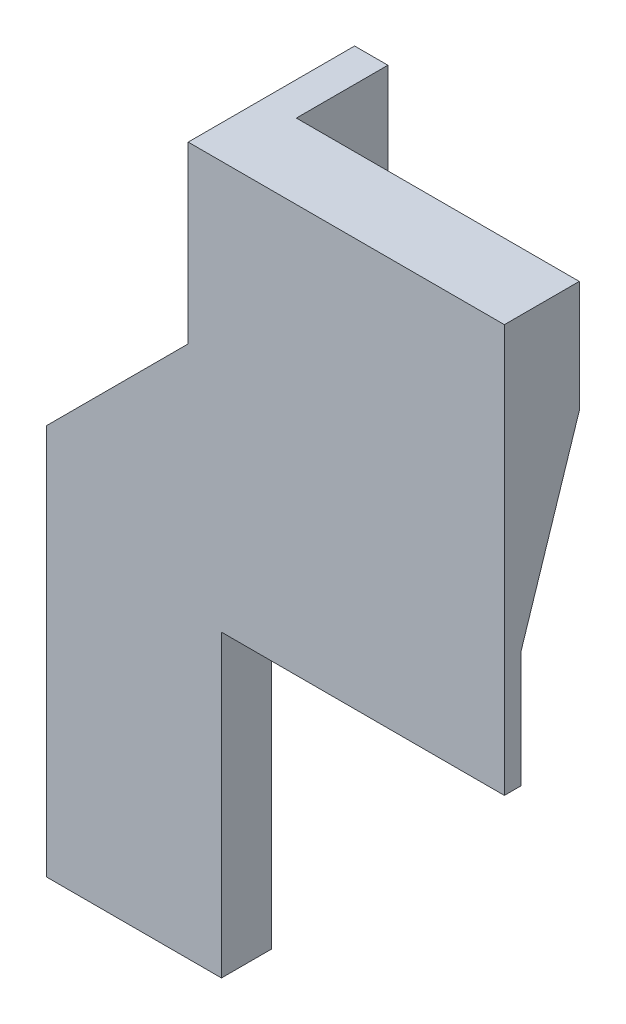
ISO-10303-21;
HEADER;
FILE_DESCRIPTION(('STEP AP214'),'2;1');
FILE_NAME('part.step','',(''),(''),'','','');
FILE_SCHEMA(('AUTOMOTIVE_DESIGN { 1 0 10303 214 1 1 1 1 }'));
ENDSEC;
DATA;
#1=APPLICATION_CONTEXT('core data for automotive mechanical design processes');
#2=APPLICATION_PROTOCOL_DEFINITION('international standard','automotive_design',2000,#1);
#3=PRODUCT_CONTEXT('',#1,'mechanical');
#4=PRODUCT('Part','Part','',(#3));
#5=PRODUCT_RELATED_PRODUCT_CATEGORY('part','',(#4));
#6=PRODUCT_DEFINITION_FORMATION('','',#4);
#7=PRODUCT_DEFINITION_CONTEXT('part definition',#1,'design');
#8=PRODUCT_DEFINITION('design','',#6,#7);
#9=PRODUCT_DEFINITION_SHAPE('','',#8);
#10=(LENGTH_UNIT() NAMED_UNIT(*) SI_UNIT(.MILLI.,.METRE.));
#11=(NAMED_UNIT(*) PLANE_ANGLE_UNIT() SI_UNIT($,.RADIAN.));
#12=(NAMED_UNIT(*) SI_UNIT($,.STERADIAN.) SOLID_ANGLE_UNIT());
#13=UNCERTAINTY_MEASURE_WITH_UNIT(LENGTH_MEASURE(1.E-05),#10,'distance_accuracy_value','');
#14=(GEOMETRIC_REPRESENTATION_CONTEXT(3) GLOBAL_UNCERTAINTY_ASSIGNED_CONTEXT((#13)) GLOBAL_UNIT_ASSIGNED_CONTEXT((#10,
#11,#12)) REPRESENTATION_CONTEXT('',''));
#15=CARTESIAN_POINT('',(0.,0.,0.));
#16=DIRECTION('',(0.,0.,1.));
#17=DIRECTION('',(1.,0.,0.));
#18=AXIS2_PLACEMENT_3D('',#15,#16,#17);
#19=CARTESIAN_POINT('',(0.,0.,2.));
#20=DIRECTION('',(0.,0.,1.));
#21=DIRECTION('',(1.,0.,0.));
#22=AXIS2_PLACEMENT_3D('',#19,#20,#21);
#23=PLANE('',#22);
#24=DIRECTION('',(1.,0.,0.));
#25=VECTOR('',#24,1.);
#26=CARTESIAN_POINT('',(-15.,36.,2.));
#27=LINE('',#26,#25);
#28=CARTESIAN_POINT('',(-15.,36.,2.));
#29=VERTEX_POINT('',#28);
#30=CARTESIAN_POINT('',(19.,36.,2.));
#31=VERTEX_POINT('',#30);
#32=EDGE_CURVE('E252',#29,#31,#27,.T.);
#33=ORIENTED_EDGE('',*,*,#32,.T.);
#34=DIRECTION('',(0.,-1.,0.));
#35=VECTOR('',#34,1.);
#36=CARTESIAN_POINT('',(19.,85.,2.));
#37=LINE('',#36,#35);
#38=CARTESIAN_POINT('',(19.,85.,2.));
#39=VERTEX_POINT('',#38);
#40=EDGE_CURVE('E157',#39,#31,#37,.T.);
#41=ORIENTED_EDGE('',*,*,#40,.F.);
#42=DIRECTION('',(1.,0.,0.));
#43=VECTOR('',#42,1.);
#44=CARTESIAN_POINT('',(-19.,85.,2.));
#45=LINE('',#44,#43);
#46=CARTESIAN_POINT('',(-19.,85.,2.));
#47=VERTEX_POINT('',#46);
#48=EDGE_CURVE('E153',#47,#39,#45,.T.);
#49=ORIENTED_EDGE('',*,*,#48,.F.);
#50=DIRECTION('',(0.,1.,0.));
#51=VECTOR('',#50,1.);
#52=CARTESIAN_POINT('',(-19.,64.,2.));
#53=LINE('',#52,#51);
#54=CARTESIAN_POINT('',(-19.,64.,2.));
#55=VERTEX_POINT('',#54);
#56=EDGE_CURVE('E215',#55,#47,#53,.T.);
#57=ORIENTED_EDGE('',*,*,#56,.F.);
#58=DIRECTION('',(0.707106781186548,0.707106781186547,0.));
#59=VECTOR('',#58,1.);
#60=CARTESIAN_POINT('',(-36.,47.,2.));
#61=LINE('',#60,#59);
#62=CARTESIAN_POINT('',(-36.,47.,2.));
#63=VERTEX_POINT('',#62);
#64=EDGE_CURVE('E220',#63,#55,#61,.T.);
#65=ORIENTED_EDGE('',*,*,#64,.F.);
#66=DIRECTION('',(0.,1.,0.));
#67=VECTOR('',#66,1.);
#68=CARTESIAN_POINT('',(-36.,0.,2.));
#69=LINE('',#68,#67);
#70=CARTESIAN_POINT('',(-36.,0.,2.));
#71=VERTEX_POINT('',#70);
#72=EDGE_CURVE('E224',#71,#63,#69,.T.);
#73=ORIENTED_EDGE('',*,*,#72,.F.);
#74=DIRECTION('',(1.,0.,0.));
#75=VECTOR('',#74,1.);
#76=CARTESIAN_POINT('',(-30.,0.,2.));
#77=LINE('',#76,#75);
#78=CARTESIAN_POINT('',(-15.,0.,2.));
#79=VERTEX_POINT('',#78);
#80=EDGE_CURVE('E247',#71,#79,#77,.T.);
#81=ORIENTED_EDGE('',*,*,#80,.T.);
#82=DIRECTION('',(0.,1.,0.));
#83=VECTOR('',#82,1.);
#84=CARTESIAN_POINT('',(-15.,0.,2.));
#85=LINE('',#84,#83);
#86=EDGE_CURVE('E250',#79,#29,#85,.T.);
#87=ORIENTED_EDGE('',*,*,#86,.T.);
#88=EDGE_LOOP('',(#33,#41,#49,#57,#65,#73,#81,#87));
#89=FACE_BOUND('',#88,.T.);
#90=ADVANCED_FACE('F33',(#89),#23,.T.);
#91=CARTESIAN_POINT('',(-76.400325732035,71.5437847602267,-6.99999999999999));
#92=DIRECTION('',(0.,0.,-1.));
#93=DIRECTION('',(-1.,0.,0.));
#94=AXIS2_PLACEMENT_3D('',#91,#92,#93);
#95=PLANE('',#94);
#96=DIRECTION('',(0.,-1.,0.));
#97=VECTOR('',#96,1.);
#98=CARTESIAN_POINT('',(-15.,71.5437847602267,-6.99999999999999));
#99=LINE('',#98,#97);
#100=CARTESIAN_POINT('',(-15.,85.,-6.99999999999999));
#101=VERTEX_POINT('',#100);
#102=CARTESIAN_POINT('',(-15.,71.5437847602267,-6.99999999999999));
#103=VERTEX_POINT('',#102);
#104=EDGE_CURVE('E146',#101,#103,#99,.T.);
#105=ORIENTED_EDGE('',*,*,#104,.F.);
#106=DIRECTION('',(-1.,0.,0.));
#107=VECTOR('',#106,1.);
#108=CARTESIAN_POINT('',(15.,85.,-6.99999999999999));
#109=LINE('',#108,#107);
#110=CARTESIAN_POINT('',(19.,85.,-6.99999999999999));
#111=VERTEX_POINT('',#110);
#112=EDGE_CURVE('E140',#111,#101,#109,.T.);
#113=ORIENTED_EDGE('',*,*,#112,.F.);
#114=DIRECTION('',(0.,1.,0.));
#115=VECTOR('',#114,1.);
#116=CARTESIAN_POINT('',(19.,71.5437847602267,-6.99999999999999));
#117=LINE('',#116,#115);
#118=CARTESIAN_POINT('',(19.,71.5437847602267,-6.99999999999999));
#119=VERTEX_POINT('',#118);
#120=EDGE_CURVE('E145',#119,#111,#117,.T.);
#121=ORIENTED_EDGE('',*,*,#120,.F.);
#122=DIRECTION('',(1.,0.,0.));
#123=VECTOR('',#122,1.);
#124=CARTESIAN_POINT('',(-76.400325732035,71.5437847602267,-6.99999999999999));
#125=LINE('',#124,#123);
#126=EDGE_CURVE('E239',#103,#119,#125,.T.);
#127=ORIENTED_EDGE('',*,*,#126,.F.);
#128=EDGE_LOOP('',(#105,#113,#121,#127));
#129=FACE_BOUND('',#128,.T.);
#130=ADVANCED_FACE('F142',(#129),#95,.T.);
#131=CARTESIAN_POINT('',(-19.,64.,114.969022302576));
#132=DIRECTION('',(-1.,0.,0.));
#133=DIRECTION('',(0.,0.,1.));
#134=AXIS2_PLACEMENT_3D('',#131,#132,#133);
#135=PLANE('',#134);
#136=ORIENTED_EDGE('',*,*,#56,.T.);
#137=DIRECTION('',(0.,0.,1.));
#138=VECTOR('',#137,1.);
#139=CARTESIAN_POINT('',(-19.,85.,-18.));
#140=LINE('',#139,#138);
#141=CARTESIAN_POINT('',(-19.,85.,-18.));
#142=VERTEX_POINT('',#141);
#143=EDGE_CURVE('E175',#142,#47,#140,.T.);
#144=ORIENTED_EDGE('',*,*,#143,.F.);
#145=DIRECTION('',(0.,1.,0.));
#146=VECTOR('',#145,1.);
#147=CARTESIAN_POINT('',(-19.,64.,-18.));
#148=LINE('',#147,#146);
#149=CARTESIAN_POINT('',(-19.,64.,-18.));
#150=VERTEX_POINT('',#149);
#151=EDGE_CURVE('E195',#150,#142,#148,.T.);
#152=ORIENTED_EDGE('',*,*,#151,.F.);
#153=DIRECTION('',(0.,0.,-1.));
#154=VECTOR('',#153,1.);
#155=CARTESIAN_POINT('',(-19.,64.,114.969022302576));
#156=LINE('',#155,#154);
#157=EDGE_CURVE('E219',#55,#150,#156,.T.);
#158=ORIENTED_EDGE('',*,*,#157,.F.);
#159=EDGE_LOOP('',(#136,#144,#152,#158));
#160=FACE_BOUND('',#159,.T.);
#161=ADVANCED_FACE('F286',(#160),#135,.T.);
#162=CARTESIAN_POINT('',(-15.,111.,-18.));
#163=DIRECTION('',(-1.,0.,0.));
#164=DIRECTION('',(0.,-1.,0.));
#165=AXIS2_PLACEMENT_3D('',#162,#163,#164);
#166=PLANE('',#165);
#167=DIRECTION('',(0.,0.,-1.));
#168=VECTOR('',#167,1.);
#169=CARTESIAN_POINT('',(-15.,85.,-6.99999999999999));
#170=LINE('',#169,#168);
#171=CARTESIAN_POINT('',(-15.,85.,-18.));
#172=VERTEX_POINT('',#171);
#173=EDGE_CURVE('E48',#101,#172,#170,.T.);
#174=ORIENTED_EDGE('',*,*,#173,.F.);
#175=ORIENTED_EDGE('',*,*,#104,.T.);
#176=DIRECTION('',(0.,-0.951056516295153,0.309016994374948));
#177=VECTOR('',#176,1.);
#178=CARTESIAN_POINT('',(-15.,50.,0.));
#179=LINE('',#178,#177);
#180=CARTESIAN_POINT('',(-15.,62.3431457505076,-4.01053116781343));
#181=VERTEX_POINT('',#180);
#182=EDGE_CURVE('E242',#103,#181,#179,.T.);
#183=ORIENTED_EDGE('',*,*,#182,.T.);
#184=DIRECTION('',(0.,0.,1.));
#185=VECTOR('',#184,1.);
#186=CARTESIAN_POINT('',(-15.,62.3431457505076,-18.));
#187=LINE('',#186,#185);
#188=CARTESIAN_POINT('',(-15.,62.3431457505076,-18.));
#189=VERTEX_POINT('',#188);
#190=EDGE_CURVE('E208',#189,#181,#187,.T.);
#191=ORIENTED_EDGE('',*,*,#190,.F.);
#192=DIRECTION('',(0.,-1.,0.));
#193=VECTOR('',#192,1.);
#194=CARTESIAN_POINT('',(-15.,111.,-18.));
#195=LINE('',#194,#193);
#196=EDGE_CURVE('E179',#172,#189,#195,.T.);
#197=ORIENTED_EDGE('',*,*,#196,.F.);
#198=EDGE_LOOP('',(#174,#175,#183,#191,#197));
#199=FACE_BOUND('',#198,.T.);
#200=ADVANCED_FACE('F273',(#199),#166,.F.);
#201=CARTESIAN_POINT('',(0.,0.,-18.));
#202=DIRECTION('',(0.,0.,-1.));
#203=DIRECTION('',(-1.,0.,0.));
#204=AXIS2_PLACEMENT_3D('',#201,#202,#203);
#205=PLANE('',#204);
#206=ORIENTED_EDGE('',*,*,#151,.T.);
#207=DIRECTION('',(-1.,0.,0.));
#208=VECTOR('',#207,1.);
#209=CARTESIAN_POINT('',(-15.,85.,-18.));
#210=LINE('',#209,#208);
#211=EDGE_CURVE('E173',#172,#142,#210,.T.);
#212=ORIENTED_EDGE('',*,*,#211,.F.);
#213=ORIENTED_EDGE('',*,*,#196,.T.);
#214=DIRECTION('',(-0.707106781186548,-0.707106781186547,0.));
#215=VECTOR('',#214,1.);
#216=CARTESIAN_POINT('',(-32.,45.3431457505076,-18.));
#217=LINE('',#216,#215);
#218=CARTESIAN_POINT('',(-32.,45.3431457505076,-18.));
#219=VERTEX_POINT('',#218);
#220=EDGE_CURVE('E181',#189,#219,#217,.T.);
#221=ORIENTED_EDGE('',*,*,#220,.T.);
#222=DIRECTION('',(0.,-1.,0.));
#223=VECTOR('',#222,1.);
#224=CARTESIAN_POINT('',(-32.,0.,-18.));
#225=LINE('',#224,#223);
#226=CARTESIAN_POINT('',(-32.,0.,-18.));
#227=VERTEX_POINT('',#226);
#228=EDGE_CURVE('E184',#219,#227,#225,.T.);
#229=ORIENTED_EDGE('',*,*,#228,.T.);
#230=DIRECTION('',(-1.,0.,0.));
#231=VECTOR('',#230,1.);
#232=CARTESIAN_POINT('',(-32.,0.,-18.));
#233=LINE('',#232,#231);
#234=CARTESIAN_POINT('',(-36.,0.,-18.));
#235=VERTEX_POINT('',#234);
#236=EDGE_CURVE('E186',#227,#235,#233,.T.);
#237=ORIENTED_EDGE('',*,*,#236,.T.);
#238=DIRECTION('',(0.,1.,0.));
#239=VECTOR('',#238,1.);
#240=CARTESIAN_POINT('',(-36.,0.,-18.));
#241=LINE('',#240,#239);
#242=CARTESIAN_POINT('',(-36.,47.,-18.));
#243=VERTEX_POINT('',#242);
#244=EDGE_CURVE('E189',#235,#243,#241,.T.);
#245=ORIENTED_EDGE('',*,*,#244,.T.);
#246=DIRECTION('',(0.707106781186548,0.707106781186547,0.));
#247=VECTOR('',#246,1.);
#248=CARTESIAN_POINT('',(-36.,47.,-18.));
#249=LINE('',#248,#247);
#250=EDGE_CURVE('E192',#243,#150,#249,.T.);
#251=ORIENTED_EDGE('',*,*,#250,.T.);
#252=EDGE_LOOP('',(#206,#212,#213,#221,#229,#237,#245,#251));
#253=FACE_BOUND('',#252,.T.);
#254=ADVANCED_FACE('F281',(#253),#205,.T.);
#255=CARTESIAN_POINT('',(-15.,50.,2.));
#256=DIRECTION('',(1.,0.,0.));
#257=DIRECTION('',(0.,0.,-1.));
#258=AXIS2_PLACEMENT_3D('',#255,#256,#257);
#259=PLANE('',#258);
#260=CARTESIAN_POINT('',(-15.,62.3431457505076,-4.));
#261=VERTEX_POINT('',#260);
#262=EDGE_CURVE('E56',#181,#261,#187,.T.);
#263=ORIENTED_EDGE('',*,*,#262,.F.);
#264=CARTESIAN_POINT('',(-15.,62.3107341487011,-4.00000000000002));
#265=VERTEX_POINT('',#264);
#266=EDGE_CURVE('E246',#181,#265,#179,.T.);
#267=ORIENTED_EDGE('',*,*,#266,.T.);
#268=DIRECTION('',(0.,-1.,0.));
#269=VECTOR('',#268,1.);
#270=CARTESIAN_POINT('',(-15.,111.,-4.));
#271=LINE('',#270,#269);
#272=EDGE_CURVE('E211',#261,#265,#271,.T.);
#273=ORIENTED_EDGE('',*,*,#272,.F.);
#274=EDGE_LOOP('',(#263,#267,#273));
#275=FACE_BOUND('',#274,.T.);
#276=ADVANCED_FACE('F299',(#275),#259,.F.);
#277=CARTESIAN_POINT('',(0.,0.,-4.));
#278=DIRECTION('',(0.,0.,1.));
#279=DIRECTION('',(1.,0.,0.));
#280=AXIS2_PLACEMENT_3D('',#277,#278,#279);
#281=PLANE('',#280);
#282=DIRECTION('',(-0.707106781186548,-0.707106781186547,0.));
#283=VECTOR('',#282,1.);
#284=CARTESIAN_POINT('',(-32.,45.3431457505076,-4.));
#285=LINE('',#284,#283);
#286=CARTESIAN_POINT('',(-32.,45.3431457505076,-4.));
#287=VERTEX_POINT('',#286);
#288=EDGE_CURVE('E178',#261,#287,#285,.T.);
#289=ORIENTED_EDGE('',*,*,#288,.F.);
#290=ORIENTED_EDGE('',*,*,#272,.T.);
#291=DIRECTION('',(0.,-1.,0.));
#292=VECTOR('',#291,1.);
#293=CARTESIAN_POINT('',(-15.,0.,-4.));
#294=LINE('',#293,#292);
#295=CARTESIAN_POINT('',(-15.,0.,-4.));
#296=VERTEX_POINT('',#295);
#297=EDGE_CURVE('E230',#265,#296,#294,.T.);
#298=ORIENTED_EDGE('',*,*,#297,.T.);
#299=DIRECTION('',(-1.,0.,0.));
#300=VECTOR('',#299,1.);
#301=CARTESIAN_POINT('',(-30.,0.,-4.));
#302=LINE('',#301,#300);
#303=CARTESIAN_POINT('',(-32.,0.,-4.));
#304=VERTEX_POINT('',#303);
#305=EDGE_CURVE('E233',#296,#304,#302,.T.);
#306=ORIENTED_EDGE('',*,*,#305,.T.);
#307=DIRECTION('',(0.,-1.,0.));
#308=VECTOR('',#307,1.);
#309=CARTESIAN_POINT('',(-32.,0.,-4.));
#310=LINE('',#309,#308);
#311=EDGE_CURVE('E182',#287,#304,#310,.T.);
#312=ORIENTED_EDGE('',*,*,#311,.F.);
#313=EDGE_LOOP('',(#289,#290,#298,#306,#312));
#314=FACE_BOUND('',#313,.T.);
#315=ADVANCED_FACE('F298',(#314),#281,.F.);
#316=CARTESIAN_POINT('',(0.,0.,0.));
#317=DIRECTION('',(0.,0.,1.));
#318=DIRECTION('',(1.,0.,0.));
#319=AXIS2_PLACEMENT_3D('',#316,#317,#318);
#320=PLANE('',#319);
#321=DIRECTION('',(0.,-1.,0.));
#322=VECTOR('',#321,1.);
#323=CARTESIAN_POINT('',(-15.,0.,0.));
#324=LINE('',#323,#322);
#325=CARTESIAN_POINT('',(-15.,50.,0.));
#326=VERTEX_POINT('',#325);
#327=CARTESIAN_POINT('',(-15.,36.,0.));
#328=VERTEX_POINT('',#327);
#329=EDGE_CURVE('E218',#326,#328,#324,.T.);
#330=ORIENTED_EDGE('',*,*,#329,.F.);
#331=DIRECTION('',(1.,0.,0.));
#332=VECTOR('',#331,1.);
#333=CARTESIAN_POINT('',(-76.400325732035,50.,0.));
#334=LINE('',#333,#332);
#335=CARTESIAN_POINT('',(19.,50.,0.));
#336=VERTEX_POINT('',#335);
#337=EDGE_CURVE('E235',#326,#336,#334,.T.);
#338=ORIENTED_EDGE('',*,*,#337,.T.);
#339=DIRECTION('',(0.,1.,0.));
#340=VECTOR('',#339,1.);
#341=CARTESIAN_POINT('',(19.,36.,0.));
#342=LINE('',#341,#340);
#343=CARTESIAN_POINT('',(19.,36.,0.));
#344=VERTEX_POINT('',#343);
#345=EDGE_CURVE('E169',#344,#336,#342,.T.);
#346=ORIENTED_EDGE('',*,*,#345,.F.);
#347=DIRECTION('',(1.,0.,0.));
#348=VECTOR('',#347,1.);
#349=CARTESIAN_POINT('',(-15.,36.,0.));
#350=LINE('',#349,#348);
#351=EDGE_CURVE('E245',#328,#344,#350,.T.);
#352=ORIENTED_EDGE('',*,*,#351,.F.);
#353=EDGE_LOOP('',(#330,#338,#346,#352));
#354=FACE_BOUND('',#353,.T.);
#355=ADVANCED_FACE('F265',(#354),#320,.F.);
#356=CARTESIAN_POINT('',(-30.,0.,2.));
#357=DIRECTION('',(0.,1.,0.));
#358=DIRECTION('',(-1.,0.,0.));
#359=AXIS2_PLACEMENT_3D('',#356,#357,#358);
#360=PLANE('',#359);
#361=ORIENTED_EDGE('',*,*,#80,.F.);
#362=DIRECTION('',(0.,0.,-1.));
#363=VECTOR('',#362,1.);
#364=CARTESIAN_POINT('',(-36.,0.,114.969022302576));
#365=LINE('',#364,#363);
#366=EDGE_CURVE('E214',#71,#235,#365,.T.);
#367=ORIENTED_EDGE('',*,*,#366,.T.);
#368=ORIENTED_EDGE('',*,*,#236,.F.);
#369=DIRECTION('',(0.,0.,1.));
#370=VECTOR('',#369,1.);
#371=CARTESIAN_POINT('',(-32.,0.,-18.));
#372=LINE('',#371,#370);
#373=EDGE_CURVE('E198',#227,#304,#372,.T.);
#374=ORIENTED_EDGE('',*,*,#373,.T.);
#375=ORIENTED_EDGE('',*,*,#305,.F.);
#376=DIRECTION('',(0.,0.,-1.));
#377=VECTOR('',#376,1.);
#378=CARTESIAN_POINT('',(-15.,0.,2.));
#379=LINE('',#378,#377);
#380=EDGE_CURVE('E11',#79,#296,#379,.T.);
#381=ORIENTED_EDGE('',*,*,#380,.F.);
#382=EDGE_LOOP('',(#361,#367,#368,#374,#375,#381));
#383=FACE_BOUND('',#382,.T.);
#384=ADVANCED_FACE('F35',(#383),#360,.F.);
#385=CARTESIAN_POINT('',(-15.,0.,2.));
#386=DIRECTION('',(-1.,0.,0.));
#387=DIRECTION('',(0.,0.,1.));
#388=AXIS2_PLACEMENT_3D('',#385,#386,#387);
#389=PLANE('',#388);
#390=ORIENTED_EDGE('',*,*,#380,.T.);
#391=ORIENTED_EDGE('',*,*,#297,.F.);
#392=EDGE_CURVE('E238',#265,#326,#179,.T.);
#393=ORIENTED_EDGE('',*,*,#392,.T.);
#394=ORIENTED_EDGE('',*,*,#329,.T.);
#395=DIRECTION('',(0.,0.,-1.));
#396=VECTOR('',#395,1.);
#397=CARTESIAN_POINT('',(-15.,36.,2.));
#398=LINE('',#397,#396);
#399=EDGE_CURVE('E41',#29,#328,#398,.T.);
#400=ORIENTED_EDGE('',*,*,#399,.F.);
#401=ORIENTED_EDGE('',*,*,#86,.F.);
#402=EDGE_LOOP('',(#390,#391,#393,#394,#400,#401));
#403=FACE_BOUND('',#402,.T.);
#404=ADVANCED_FACE('F292',(#403),#389,.F.);
#405=CARTESIAN_POINT('',(-15.,36.,2.));
#406=DIRECTION('',(0.,1.,0.));
#407=DIRECTION('',(0.,0.,1.));
#408=AXIS2_PLACEMENT_3D('',#405,#406,#407);
#409=PLANE('',#408);
#410=ORIENTED_EDGE('',*,*,#351,.T.);
#411=DIRECTION('',(0.,0.,-1.));
#412=VECTOR('',#411,1.);
#413=CARTESIAN_POINT('',(19.,36.,2.));
#414=LINE('',#413,#412);
#415=EDGE_CURVE('E166',#31,#344,#414,.T.);
#416=ORIENTED_EDGE('',*,*,#415,.F.);
#417=ORIENTED_EDGE('',*,*,#32,.F.);
#418=ORIENTED_EDGE('',*,*,#399,.T.);
#419=EDGE_LOOP('',(#410,#416,#417,#418));
#420=FACE_BOUND('',#419,.T.);
#421=ADVANCED_FACE('F259',(#420),#409,.F.);
#422=CARTESIAN_POINT('',(-76.400325732035,50.,0.));
#423=DIRECTION('',(0.,-0.309016994374948,-0.951056516295153));
#424=DIRECTION('',(0.,0.951056516295153,-0.309016994374948));
#425=AXIS2_PLACEMENT_3D('',#422,#423,#424);
#426=PLANE('',#425);
#427=ORIENTED_EDGE('',*,*,#182,.F.);
#428=ORIENTED_EDGE('',*,*,#126,.T.);
#429=DIRECTION('',(0.,0.951056516295154,-0.309016994374948));
#430=VECTOR('',#429,1.);
#431=CARTESIAN_POINT('',(19.,50.,0.));
#432=LINE('',#431,#430);
#433=EDGE_CURVE('E147',#336,#119,#432,.T.);
#434=ORIENTED_EDGE('',*,*,#433,.F.);
#435=ORIENTED_EDGE('',*,*,#337,.F.);
#436=ORIENTED_EDGE('',*,*,#392,.F.);
#437=ORIENTED_EDGE('',*,*,#266,.F.);
#438=EDGE_LOOP('',(#427,#428,#434,#435,#436,#437));
#439=FACE_BOUND('',#438,.T.);
#440=ADVANCED_FACE('F269',(#439),#426,.T.);
#441=CARTESIAN_POINT('',(-36.,0.,114.969022302576));
#442=DIRECTION('',(-1.,0.,0.));
#443=DIRECTION('',(0.,0.,1.));
#444=AXIS2_PLACEMENT_3D('',#441,#442,#443);
#445=PLANE('',#444);
#446=ORIENTED_EDGE('',*,*,#366,.F.);
#447=ORIENTED_EDGE('',*,*,#72,.T.);
#448=DIRECTION('',(0.,0.,-1.));
#449=VECTOR('',#448,1.);
#450=CARTESIAN_POINT('',(-36.,47.,114.969022302576));
#451=LINE('',#450,#449);
#452=EDGE_CURVE('E223',#63,#243,#451,.T.);
#453=ORIENTED_EDGE('',*,*,#452,.T.);
#454=ORIENTED_EDGE('',*,*,#244,.F.);
#455=EDGE_LOOP('',(#446,#447,#453,#454));
#456=FACE_BOUND('',#455,.T.);
#457=ADVANCED_FACE('F330',(#456),#445,.T.);
#458=CARTESIAN_POINT('',(-36.,47.,114.969022302576));
#459=DIRECTION('',(-0.707106781186547,0.707106781186548,0.));
#460=DIRECTION('',(-0.707106781186548,-0.707106781186547,0.));
#461=AXIS2_PLACEMENT_3D('',#458,#459,#460);
#462=PLANE('',#461);
#463=ORIENTED_EDGE('',*,*,#452,.F.);
#464=ORIENTED_EDGE('',*,*,#64,.T.);
#465=ORIENTED_EDGE('',*,*,#157,.T.);
#466=ORIENTED_EDGE('',*,*,#250,.F.);
#467=EDGE_LOOP('',(#463,#464,#465,#466));
#468=FACE_BOUND('',#467,.T.);
#469=ADVANCED_FACE('F334',(#468),#462,.T.);
#470=CARTESIAN_POINT('',(-32.,45.3431457505076,-18.));
#471=DIRECTION('',(-0.707106781186548,0.707106781186548,0.));
#472=DIRECTION('',(-0.707106781186548,-0.707106781186547,0.));
#473=AXIS2_PLACEMENT_3D('',#470,#471,#472);
#474=PLANE('',#473);
#475=ORIENTED_EDGE('',*,*,#288,.T.);
#476=DIRECTION('',(0.,0.,1.));
#477=VECTOR('',#476,1.);
#478=CARTESIAN_POINT('',(-32.,45.3431457505076,-18.));
#479=LINE('',#478,#477);
#480=EDGE_CURVE('E205',#219,#287,#479,.T.);
#481=ORIENTED_EDGE('',*,*,#480,.F.);
#482=ORIENTED_EDGE('',*,*,#220,.F.);
#483=ORIENTED_EDGE('',*,*,#190,.T.);
#484=ORIENTED_EDGE('',*,*,#262,.T.);
#485=EDGE_LOOP('',(#475,#481,#482,#483,#484));
#486=FACE_BOUND('',#485,.T.);
#487=ADVANCED_FACE('F277',(#486),#474,.F.);
#488=CARTESIAN_POINT('',(-32.,0.,-18.));
#489=DIRECTION('',(-1.,0.,0.));
#490=DIRECTION('',(0.,-1.,0.));
#491=AXIS2_PLACEMENT_3D('',#488,#489,#490);
#492=PLANE('',#491);
#493=ORIENTED_EDGE('',*,*,#311,.T.);
#494=ORIENTED_EDGE('',*,*,#373,.F.);
#495=ORIENTED_EDGE('',*,*,#228,.F.);
#496=ORIENTED_EDGE('',*,*,#480,.T.);
#497=EDGE_LOOP('',(#493,#494,#495,#496));
#498=FACE_BOUND('',#497,.T.);
#499=ADVANCED_FACE('F350',(#498),#492,.F.);
#500=CARTESIAN_POINT('',(0.,85.,0.));
#501=DIRECTION('',(0.,1.,0.));
#502=DIRECTION('',(0.,0.,1.));
#503=AXIS2_PLACEMENT_3D('',#500,#501,#502);
#504=PLANE('',#503);
#505=ORIENTED_EDGE('',*,*,#48,.T.);
#506=DIRECTION('',(0.,0.,1.));
#507=VECTOR('',#506,1.);
#508=CARTESIAN_POINT('',(19.,85.,-6.99999999999999));
#509=LINE('',#508,#507);
#510=EDGE_CURVE('E150',#111,#39,#509,.T.);
#511=ORIENTED_EDGE('',*,*,#510,.F.);
#512=ORIENTED_EDGE('',*,*,#112,.T.);
#513=ORIENTED_EDGE('',*,*,#173,.T.);
#514=ORIENTED_EDGE('',*,*,#211,.T.);
#515=ORIENTED_EDGE('',*,*,#143,.T.);
#516=EDGE_LOOP('',(#505,#511,#512,#513,#514,#515));
#517=FACE_BOUND('',#516,.T.);
#518=ADVANCED_FACE('F151',(#517),#504,.T.);
#519=CARTESIAN_POINT('',(19.,0.,0.));
#520=DIRECTION('',(1.,0.,0.));
#521=DIRECTION('',(0.,1.,0.));
#522=AXIS2_PLACEMENT_3D('',#519,#520,#521);
#523=PLANE('',#522);
#524=ORIENTED_EDGE('',*,*,#120,.T.);
#525=ORIENTED_EDGE('',*,*,#510,.T.);
#526=ORIENTED_EDGE('',*,*,#40,.T.);
#527=ORIENTED_EDGE('',*,*,#415,.T.);
#528=ORIENTED_EDGE('',*,*,#345,.T.);
#529=ORIENTED_EDGE('',*,*,#433,.T.);
#530=EDGE_LOOP('',(#524,#525,#526,#527,#528,#529));
#531=FACE_BOUND('',#530,.T.);
#532=ADVANCED_FACE('F160',(#531),#523,.T.);
#533=CLOSED_SHELL('',(#90,#130,#161,#200,#254,#276,#315,#355,#384,#404,#421,#440,#457,#469,#487,
#499,#518,#532));
#534=MANIFOLD_SOLID_BREP('B2',#533);
#535=ADVANCED_BREP_SHAPE_REPRESENTATION('',(#18,#534),#14);
#536=SHAPE_DEFINITION_REPRESENTATION(#9,#535);
ENDSEC;
END-ISO-10303-21;
